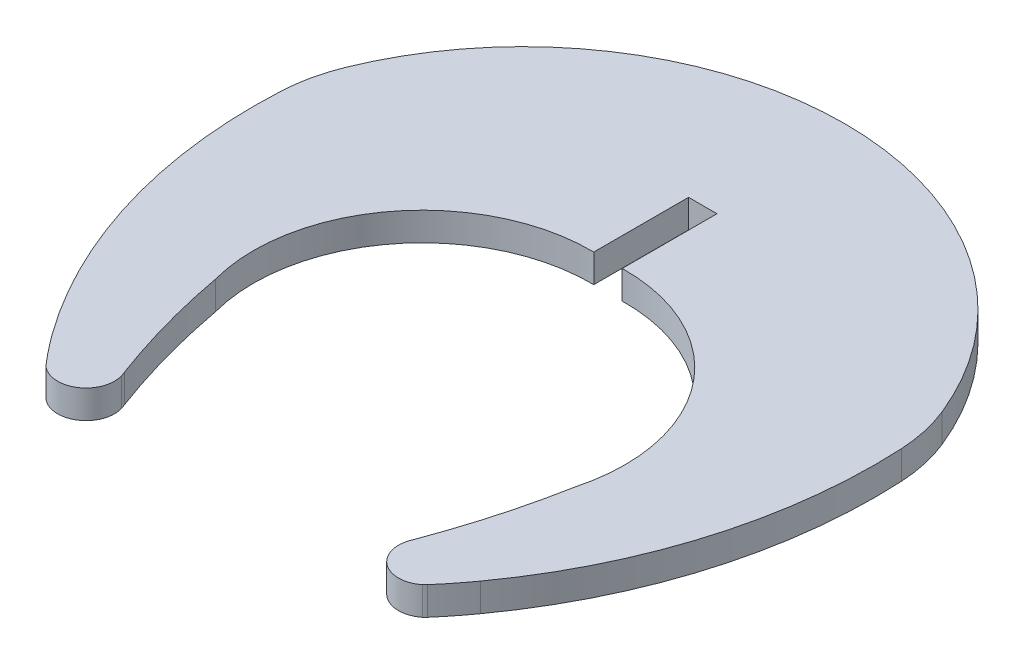
ISO-10303-21;
HEADER;
FILE_DESCRIPTION(('STEP AP214'),'2;1');
FILE_NAME('part.step','',(''),(''),'','','');
FILE_SCHEMA(('AUTOMOTIVE_DESIGN { 1 0 10303 214 1 1 1 1 }'));
ENDSEC;
DATA;
#1=APPLICATION_CONTEXT('core data for automotive mechanical design processes');
#2=APPLICATION_PROTOCOL_DEFINITION('international standard','automotive_design',2000,#1);
#3=PRODUCT_CONTEXT('',#1,'mechanical');
#4=PRODUCT('Part','Part','',(#3));
#5=PRODUCT_RELATED_PRODUCT_CATEGORY('part','',(#4));
#6=PRODUCT_DEFINITION_FORMATION('','',#4);
#7=PRODUCT_DEFINITION_CONTEXT('part definition',#1,'design');
#8=PRODUCT_DEFINITION('design','',#6,#7);
#9=PRODUCT_DEFINITION_SHAPE('','',#8);
#10=(LENGTH_UNIT() NAMED_UNIT(*) SI_UNIT(.MILLI.,.METRE.));
#11=(NAMED_UNIT(*) PLANE_ANGLE_UNIT() SI_UNIT($,.RADIAN.));
#12=(NAMED_UNIT(*) SI_UNIT($,.STERADIAN.) SOLID_ANGLE_UNIT());
#13=UNCERTAINTY_MEASURE_WITH_UNIT(LENGTH_MEASURE(1.E-05),#10,'distance_accuracy_value','');
#14=(GEOMETRIC_REPRESENTATION_CONTEXT(3) GLOBAL_UNCERTAINTY_ASSIGNED_CONTEXT((#13)) GLOBAL_UNIT_ASSIGNED_CONTEXT((#10,
#11,#12)) REPRESENTATION_CONTEXT('',''));
#15=CARTESIAN_POINT('',(0.,0.,0.));
#16=DIRECTION('',(0.,0.,1.));
#17=DIRECTION('',(1.,0.,0.));
#18=AXIS2_PLACEMENT_3D('',#15,#16,#17);
#19=CARTESIAN_POINT('',(182.612714371888,1.45,-181.633456238506));
#20=DIRECTION('',(0.,-1.,0.));
#21=DIRECTION('',(0.,0.,-1.));
#22=AXIS2_PLACEMENT_3D('',#19,#20,#21);
#23=CYLINDRICAL_SURFACE('',#22,16.503878528353);
#24=CARTESIAN_POINT('',(182.612714371888,0.,-181.633456238506));
#25=DIRECTION('',(0.,1.,0.));
#26=DIRECTION('',(0.,0.,1.));
#27=AXIS2_PLACEMENT_3D('',#24,#25,#26);
#28=CIRCLE('',#27,16.503878528353);
#29=CARTESIAN_POINT('',(197.904984008521,0.,-187.84026667859));
#30=VERTEX_POINT('',#29);
#31=CARTESIAN_POINT('',(167.320444243515,0.,-187.840265467047));
#32=VERTEX_POINT('',#31);
#33=EDGE_CURVE('E205',#30,#32,#28,.T.);
#34=ORIENTED_EDGE('',*,*,#33,.T.);
#35=DIRECTION('',(0.,-1.,0.));
#36=VECTOR('',#35,1.);
#37=CARTESIAN_POINT('',(167.320444243515,1.45,-187.840265467047));
#38=LINE('',#37,#36);
#39=CARTESIAN_POINT('',(167.320444243515,1.45,-187.840265467047));
#40=VERTEX_POINT('',#39);
#41=EDGE_CURVE('E11',#40,#32,#38,.T.);
#42=ORIENTED_EDGE('',*,*,#41,.F.);
#43=CARTESIAN_POINT('',(182.612714371888,1.45,-181.633456238506));
#44=DIRECTION('',(0.,1.,0.));
#45=DIRECTION('',(0.,0.,1.));
#46=AXIS2_PLACEMENT_3D('',#43,#44,#45);
#47=CIRCLE('',#46,16.503878528353);
#48=CARTESIAN_POINT('',(197.904984008521,1.45,-187.84026667859));
#49=VERTEX_POINT('',#48);
#50=EDGE_CURVE('E250',#49,#40,#47,.T.);
#51=ORIENTED_EDGE('',*,*,#50,.F.);
#52=DIRECTION('',(0.,-1.,0.));
#53=VECTOR('',#52,1.);
#54=CARTESIAN_POINT('',(197.904984008521,1.45,-187.84026667859));
#55=LINE('',#54,#53);
#56=EDGE_CURVE('E201',#49,#30,#55,.T.);
#57=ORIENTED_EDGE('',*,*,#56,.T.);
#58=EDGE_LOOP('',(#34,#42,#51,#57));
#59=FACE_BOUND('',#58,.T.);
#60=ADVANCED_FACE('F37',(#59),#23,.T.);
#61=CARTESIAN_POINT('',(175.011306634643,1.45,-184.718707417714));
#62=DIRECTION('',(0.,-1.,0.));
#63=DIRECTION('',(0.,0.,-1.));
#64=AXIS2_PLACEMENT_3D('',#61,#62,#63);
#65=CYLINDRICAL_SURFACE('',#64,8.30021017653311);
#66=CARTESIAN_POINT('',(175.011306634643,0.,-184.718707417714));
#67=DIRECTION('',(0.,1.,0.));
#68=DIRECTION('',(0.,0.,1.));
#69=AXIS2_PLACEMENT_3D('',#66,#67,#68);
#70=CIRCLE('',#69,8.30021017653311);
#71=CARTESIAN_POINT('',(166.722557517557,0.,-185.154743022486));
#72=VERTEX_POINT('',#71);
#73=EDGE_CURVE('E208',#32,#72,#70,.T.);
#74=ORIENTED_EDGE('',*,*,#73,.T.);
#75=DIRECTION('',(0.,-1.,0.));
#76=VECTOR('',#75,1.);
#77=CARTESIAN_POINT('',(166.722557517557,1.45,-185.154743022486));
#78=LINE('',#77,#76);
#79=CARTESIAN_POINT('',(166.722557517557,1.45,-185.154743022486));
#80=VERTEX_POINT('',#79);
#81=EDGE_CURVE('E45',#80,#72,#78,.T.);
#82=ORIENTED_EDGE('',*,*,#81,.F.);
#83=CARTESIAN_POINT('',(175.011306634643,1.45,-184.718707417714));
#84=DIRECTION('',(0.,1.,0.));
#85=DIRECTION('',(0.,0.,1.));
#86=AXIS2_PLACEMENT_3D('',#83,#84,#85);
#87=CIRCLE('',#86,8.30021017653311);
#88=EDGE_CURVE('E132',#40,#80,#87,.T.);
#89=ORIENTED_EDGE('',*,*,#88,.F.);
#90=ORIENTED_EDGE('',*,*,#41,.T.);
#91=EDGE_LOOP('',(#74,#82,#89,#90));
#92=FACE_BOUND('',#91,.T.);
#93=ADVANCED_FACE('F367',(#92),#65,.T.);
#94=CARTESIAN_POINT('',(192.86710672295,1.45,-183.801790058505));
#95=DIRECTION('',(0.,-1.,0.));
#96=DIRECTION('',(0.,0.,-1.));
#97=AXIS2_PLACEMENT_3D('',#94,#95,#96);
#98=CYLINDRICAL_SURFACE('',#97,26.179532747472);
#99=CARTESIAN_POINT('',(192.86710672295,0.,-183.801790058505));
#100=DIRECTION('',(0.,1.,0.));
#101=DIRECTION('',(0.,0.,1.));
#102=AXIS2_PLACEMENT_3D('',#99,#100,#101);
#103=CIRCLE('',#102,26.179532747472);
#104=CARTESIAN_POINT('',(171.632760569295,0.,-168.489361175315));
#105=VERTEX_POINT('',#104);
#106=EDGE_CURVE('E210',#72,#105,#103,.T.);
#107=ORIENTED_EDGE('',*,*,#106,.T.);
#108=DIRECTION('',(0.,-1.,0.));
#109=VECTOR('',#108,1.);
#110=CARTESIAN_POINT('',(171.632760569295,1.45,-168.489361175315));
#111=LINE('',#110,#109);
#112=CARTESIAN_POINT('',(171.632760569295,1.45,-168.489361175315));
#113=VERTEX_POINT('',#112);
#114=EDGE_CURVE('E286',#113,#105,#111,.T.);
#115=ORIENTED_EDGE('',*,*,#114,.F.);
#116=CARTESIAN_POINT('',(192.86710672295,1.45,-183.801790058505));
#117=DIRECTION('',(0.,1.,0.));
#118=DIRECTION('',(0.,0.,1.));
#119=AXIS2_PLACEMENT_3D('',#116,#117,#118);
#120=CIRCLE('',#119,26.179532747472);
#121=EDGE_CURVE('E294',#80,#113,#120,.T.);
#122=ORIENTED_EDGE('',*,*,#121,.F.);
#123=ORIENTED_EDGE('',*,*,#81,.T.);
#124=EDGE_LOOP('',(#107,#115,#122,#123));
#125=FACE_BOUND('',#124,.T.);
#126=ADVANCED_FACE('F292',(#125),#98,.T.);
#127=CARTESIAN_POINT('',(189.644454347905,1.45,-181.477881050326));
#128=DIRECTION('',(0.,-1.,0.));
#129=DIRECTION('',(0.,0.,-1.));
#130=AXIS2_PLACEMENT_3D('',#127,#128,#129);
#131=CYLINDRICAL_SURFACE('',#130,22.206367584951);
#132=CARTESIAN_POINT('',(189.644454347905,0.,-181.477881050326));
#133=DIRECTION('',(0.,1.,0.));
#134=DIRECTION('',(0.,0.,1.));
#135=AXIS2_PLACEMENT_3D('',#132,#133,#134);
#136=CIRCLE('',#135,22.206367584951);
#137=CARTESIAN_POINT('',(172.835611480412,0.,-166.966314533444));
#138=VERTEX_POINT('',#137);
#139=EDGE_CURVE('E212',#105,#138,#136,.T.);
#140=ORIENTED_EDGE('',*,*,#139,.T.);
#141=DIRECTION('',(0.,-1.,0.));
#142=VECTOR('',#141,1.);
#143=CARTESIAN_POINT('',(172.835611480412,1.45,-166.966314533444));
#144=LINE('',#143,#142);
#145=CARTESIAN_POINT('',(172.835611480412,1.45,-166.966314533444));
#146=VERTEX_POINT('',#145);
#147=EDGE_CURVE('E283',#146,#138,#144,.T.);
#148=ORIENTED_EDGE('',*,*,#147,.F.);
#149=CARTESIAN_POINT('',(189.644454347905,1.45,-181.477881050326));
#150=DIRECTION('',(0.,1.,0.));
#151=DIRECTION('',(0.,0.,1.));
#152=AXIS2_PLACEMENT_3D('',#149,#150,#151);
#153=CIRCLE('',#152,22.206367584951);
#154=EDGE_CURVE('E312',#113,#146,#153,.T.);
#155=ORIENTED_EDGE('',*,*,#154,.F.);
#156=ORIENTED_EDGE('',*,*,#114,.T.);
#157=EDGE_LOOP('',(#140,#148,#155,#156));
#158=FACE_BOUND('',#157,.T.);
#159=ADVANCED_FACE('F303',(#158),#131,.T.);
#160=CARTESIAN_POINT('',(173.759841379791,1.45,-167.764228359528));
#161=DIRECTION('',(0.,-1.,0.));
#162=DIRECTION('',(0.,0.,-1.));
#163=AXIS2_PLACEMENT_3D('',#160,#161,#162);
#164=CYLINDRICAL_SURFACE('',#163,1.22101080288459);
#165=CARTESIAN_POINT('',(173.759841379791,0.,-167.764228359528));
#166=DIRECTION('',(0.,1.,0.));
#167=DIRECTION('',(0.,0.,1.));
#168=AXIS2_PLACEMENT_3D('',#165,#166,#167);
#169=CIRCLE('',#168,1.22101080288459);
#170=CARTESIAN_POINT('',(172.966458578089,0.,-166.836106001902));
#171=VERTEX_POINT('',#170);
#172=EDGE_CURVE('E214',#138,#171,#169,.T.);
#173=ORIENTED_EDGE('',*,*,#172,.T.);
#174=DIRECTION('',(0.,-1.,0.));
#175=VECTOR('',#174,1.);
#176=CARTESIAN_POINT('',(172.966458578089,1.45,-166.836106001902));
#177=LINE('',#176,#175);
#178=CARTESIAN_POINT('',(172.966458578089,1.45,-166.836106001902));
#179=VERTEX_POINT('',#178);
#180=EDGE_CURVE('E280',#179,#171,#177,.T.);
#181=ORIENTED_EDGE('',*,*,#180,.F.);
#182=CARTESIAN_POINT('',(173.759841379791,1.45,-167.764228359528));
#183=DIRECTION('',(0.,1.,0.));
#184=DIRECTION('',(0.,0.,1.));
#185=AXIS2_PLACEMENT_3D('',#182,#183,#184);
#186=CIRCLE('',#185,1.22101080288459);
#187=EDGE_CURVE('E309',#146,#179,#186,.T.);
#188=ORIENTED_EDGE('',*,*,#187,.F.);
#189=ORIENTED_EDGE('',*,*,#147,.T.);
#190=EDGE_LOOP('',(#173,#181,#188,#189));
#191=FACE_BOUND('',#190,.T.);
#192=ADVANCED_FACE('F307',(#191),#164,.T.);
#193=CARTESIAN_POINT('',(173.874083340371,1.45,-167.977151794996));
#194=DIRECTION('',(0.,-1.,0.));
#195=DIRECTION('',(0.,0.,-1.));
#196=AXIS2_PLACEMENT_3D('',#193,#194,#195);
#197=CYLINDRICAL_SURFACE('',#196,1.45800144411667);
#198=CARTESIAN_POINT('',(173.874083340371,0.,-167.977151794996));
#199=DIRECTION('',(0.,1.,0.));
#200=DIRECTION('',(0.,0.,1.));
#201=AXIS2_PLACEMENT_3D('',#198,#199,#200);
#202=CIRCLE('',#201,1.45800144411667);
#203=CARTESIAN_POINT('',(175.271275174539,0.,-168.393832955576));
#204=VERTEX_POINT('',#203);
#205=EDGE_CURVE('E216',#171,#204,#202,.T.);
#206=ORIENTED_EDGE('',*,*,#205,.T.);
#207=DIRECTION('',(0.,-1.,0.));
#208=VECTOR('',#207,1.);
#209=CARTESIAN_POINT('',(175.271275174539,1.45,-168.393832955576));
#210=LINE('',#209,#208);
#211=CARTESIAN_POINT('',(175.271275174539,1.45,-168.393832955576));
#212=VERTEX_POINT('',#211);
#213=EDGE_CURVE('E277',#212,#204,#210,.T.);
#214=ORIENTED_EDGE('',*,*,#213,.F.);
#215=CARTESIAN_POINT('',(173.874083340371,1.45,-167.977151794996));
#216=DIRECTION('',(0.,1.,0.));
#217=DIRECTION('',(0.,0.,1.));
#218=AXIS2_PLACEMENT_3D('',#215,#216,#217);
#219=CIRCLE('',#218,1.45800144411667);
#220=EDGE_CURVE('E311',#179,#212,#219,.T.);
#221=ORIENTED_EDGE('',*,*,#220,.F.);
#222=ORIENTED_EDGE('',*,*,#180,.T.);
#223=EDGE_LOOP('',(#206,#214,#221,#222));
#224=FACE_BOUND('',#223,.T.);
#225=ADVANCED_FACE('F380',(#224),#197,.T.);
#226=CARTESIAN_POINT('',(173.127533725955,1.45,-167.754512840755));
#227=DIRECTION('',(0.,-1.,0.));
#228=DIRECTION('',(0.,0.,-1.));
#229=AXIS2_PLACEMENT_3D('',#226,#227,#228);
#230=CYLINDRICAL_SURFACE('',#229,2.23704215597095);
#231=CARTESIAN_POINT('',(173.127533725955,0.,-167.754512840755));
#232=DIRECTION('',(0.,1.,0.));
#233=DIRECTION('',(0.,0.,1.));
#234=AXIS2_PLACEMENT_3D('',#231,#232,#233);
#235=CIRCLE('',#234,2.23704215597095);
#236=CARTESIAN_POINT('',(175.186576563295,0.,-168.628984224844));
#237=VERTEX_POINT('',#236);
#238=EDGE_CURVE('E218',#204,#237,#235,.T.);
#239=ORIENTED_EDGE('',*,*,#238,.T.);
#240=DIRECTION('',(0.,-1.,0.));
#241=VECTOR('',#240,1.);
#242=CARTESIAN_POINT('',(175.186576563295,1.45,-168.628984224844));
#243=LINE('',#242,#241);
#244=CARTESIAN_POINT('',(175.186576563295,1.45,-168.628984224844));
#245=VERTEX_POINT('',#244);
#246=EDGE_CURVE('E275',#245,#237,#243,.T.);
#247=ORIENTED_EDGE('',*,*,#246,.F.);
#248=CARTESIAN_POINT('',(173.127533725955,1.45,-167.754512840755));
#249=DIRECTION('',(0.,1.,0.));
#250=DIRECTION('',(0.,0.,1.));
#251=AXIS2_PLACEMENT_3D('',#248,#249,#250);
#252=CIRCLE('',#251,2.23704215597095);
#253=EDGE_CURVE('E314',#212,#245,#252,.T.);
#254=ORIENTED_EDGE('',*,*,#253,.F.);
#255=ORIENTED_EDGE('',*,*,#213,.T.);
#256=EDGE_LOOP('',(#239,#247,#254,#255));
#257=FACE_BOUND('',#256,.T.);
#258=ADVANCED_FACE('F383',(#257),#230,.T.);
#259=CARTESIAN_POINT('',(211.313459335126,1.45,-182.154652294481));
#260=DIRECTION('',(0.,-1.,0.));
#261=DIRECTION('',(0.,0.,-1.));
#262=AXIS2_PLACEMENT_3D('',#259,#260,#261);
#263=CYLINDRICAL_SURFACE('',#262,38.575839012776);
#264=CARTESIAN_POINT('',(211.313459335126,0.,-182.154652294481));
#265=DIRECTION('',(0.,1.,0.));
#266=DIRECTION('',(0.,0.,1.));
#267=AXIS2_PLACEMENT_3D('',#264,#265,#266);
#268=CIRCLE('',#267,38.575839012776);
#269=CARTESIAN_POINT('',(173.386717996462,0.,-175.107834078456));
#270=VERTEX_POINT('',#269);
#271=EDGE_CURVE('E221',#270,#237,#268,.T.);
#272=ORIENTED_EDGE('',*,*,#271,.F.);
#273=DIRECTION('',(0.,-1.,0.));
#274=VECTOR('',#273,1.);
#275=CARTESIAN_POINT('',(173.386717996462,1.45,-175.107834078456));
#276=LINE('',#275,#274);
#277=CARTESIAN_POINT('',(173.386717996462,1.45,-175.107834078456));
#278=VERTEX_POINT('',#277);
#279=EDGE_CURVE('E273',#278,#270,#276,.T.);
#280=ORIENTED_EDGE('',*,*,#279,.F.);
#281=CARTESIAN_POINT('',(211.313459335126,1.45,-182.154652294481));
#282=DIRECTION('',(0.,1.,0.));
#283=DIRECTION('',(0.,0.,1.));
#284=AXIS2_PLACEMENT_3D('',#281,#282,#283);
#285=CIRCLE('',#284,38.575839012776);
#286=EDGE_CURVE('E320',#278,#245,#285,.T.);
#287=ORIENTED_EDGE('',*,*,#286,.T.);
#288=ORIENTED_EDGE('',*,*,#246,.T.);
#289=EDGE_LOOP('',(#272,#280,#287,#288));
#290=FACE_BOUND('',#289,.T.);
#291=ADVANCED_FACE('F387',(#290),#263,.F.);
#292=CARTESIAN_POINT('',(181.7488422074,1.45,-177.34541584711));
#293=DIRECTION('',(0.,-1.,0.));
#294=DIRECTION('',(0.,0.,-1.));
#295=AXIS2_PLACEMENT_3D('',#292,#293,#294);
#296=CYLINDRICAL_SURFACE('',#295,8.6563210136044);
#297=CARTESIAN_POINT('',(181.7488422074,0.,-177.34541584711));
#298=DIRECTION('',(0.,1.,0.));
#299=DIRECTION('',(0.,0.,1.));
#300=AXIS2_PLACEMENT_3D('',#297,#298,#299);
#301=CIRCLE('',#300,8.6563210136044);
#302=CARTESIAN_POINT('',(181.883713072282,0.,-186.000686110965));
#303=VERTEX_POINT('',#302);
#304=EDGE_CURVE('E224',#303,#270,#301,.T.);
#305=ORIENTED_EDGE('',*,*,#304,.F.);
#306=DIRECTION('',(0.,-1.,0.));
#307=VECTOR('',#306,1.);
#308=CARTESIAN_POINT('',(181.883713072282,1.45,-186.000686110965));
#309=LINE('',#308,#307);
#310=CARTESIAN_POINT('',(181.883713072282,1.45,-186.000686110965));
#311=VERTEX_POINT('',#310);
#312=EDGE_CURVE('E271',#311,#303,#309,.T.);
#313=ORIENTED_EDGE('',*,*,#312,.F.);
#314=CARTESIAN_POINT('',(181.7488422074,1.45,-177.34541584711));
#315=DIRECTION('',(0.,1.,0.));
#316=DIRECTION('',(0.,0.,1.));
#317=AXIS2_PLACEMENT_3D('',#314,#315,#316);
#318=CIRCLE('',#317,8.6563210136044);
#319=EDGE_CURVE('E323',#311,#278,#318,.T.);
#320=ORIENTED_EDGE('',*,*,#319,.T.);
#321=ORIENTED_EDGE('',*,*,#279,.T.);
#322=EDGE_LOOP('',(#305,#313,#320,#321));
#323=FACE_BOUND('',#322,.T.);
#324=ADVANCED_FACE('F391',(#323),#296,.F.);
#325=CARTESIAN_POINT('',(181.883719168316,1.45,-266.906653372685));
#326=DIRECTION('',(-0.999999999999997,0.,-7.5347145581294E-08));
#327=DIRECTION('',(-7.5347145581294E-08,0.,0.999999999999997));
#328=AXIS2_PLACEMENT_3D('',#325,#326,#327);
#329=PLANE('',#328);
#330=DIRECTION('',(7.5347145581294E-08,0.,-0.999999999999997));
#331=VECTOR('',#330,1.);
#332=CARTESIAN_POINT('',(181.883719168316,0.,-266.906653372685));
#333=LINE('',#332,#331);
#334=CARTESIAN_POINT('',(181.88371343847,0.,-190.86069175123));
#335=VERTEX_POINT('',#334);
#336=EDGE_CURVE('E227',#303,#335,#333,.T.);
#337=ORIENTED_EDGE('',*,*,#336,.T.);
#338=DIRECTION('',(0.,-1.,0.));
#339=VECTOR('',#338,1.);
#340=CARTESIAN_POINT('',(181.88371343847,1.45,-190.86069175123));
#341=LINE('',#340,#339);
#342=CARTESIAN_POINT('',(181.88371343847,1.45,-190.86069175123));
#343=VERTEX_POINT('',#342);
#344=EDGE_CURVE('E268',#343,#335,#341,.T.);
#345=ORIENTED_EDGE('',*,*,#344,.F.);
#346=DIRECTION('',(7.5347145581294E-08,0.,-0.999999999999997));
#347=VECTOR('',#346,1.);
#348=CARTESIAN_POINT('',(181.883719168316,1.45,-266.906653372685));
#349=LINE('',#348,#347);
#350=EDGE_CURVE('E326',#311,#343,#349,.T.);
#351=ORIENTED_EDGE('',*,*,#350,.F.);
#352=ORIENTED_EDGE('',*,*,#312,.T.);
#353=EDGE_LOOP('',(#337,#345,#351,#352));
#354=FACE_BOUND('',#353,.T.);
#355=ADVANCED_FACE('F395',(#354),#329,.F.);
#356=CARTESIAN_POINT('',(-48.360559474051,1.45,-190.86069175123));
#357=DIRECTION('',(0.,0.,-1.));
#358=DIRECTION('',(-1.,0.,0.));
#359=AXIS2_PLACEMENT_3D('',#356,#357,#358);
#360=PLANE('',#359);
#361=DIRECTION('',(1.,0.,0.));
#362=VECTOR('',#361,1.);
#363=CARTESIAN_POINT('',(-48.360559474051,0.,-190.86069175123));
#364=LINE('',#363,#362);
#365=CARTESIAN_POINT('',(183.341715192073,0.,-190.86069175123));
#366=VERTEX_POINT('',#365);
#367=EDGE_CURVE('E229',#335,#366,#364,.T.);
#368=ORIENTED_EDGE('',*,*,#367,.T.);
#369=DIRECTION('',(0.,-1.,0.));
#370=VECTOR('',#369,1.);
#371=CARTESIAN_POINT('',(183.341715192073,1.45,-190.86069175123));
#372=LINE('',#371,#370);
#373=CARTESIAN_POINT('',(183.341715192073,1.45,-190.86069175123));
#374=VERTEX_POINT('',#373);
#375=EDGE_CURVE('E266',#374,#366,#372,.T.);
#376=ORIENTED_EDGE('',*,*,#375,.F.);
#377=DIRECTION('',(1.,0.,0.));
#378=VECTOR('',#377,1.);
#379=CARTESIAN_POINT('',(-48.360559474051,1.45,-190.86069175123));
#380=LINE('',#379,#378);
#381=EDGE_CURVE('E328',#343,#374,#380,.T.);
#382=ORIENTED_EDGE('',*,*,#381,.F.);
#383=ORIENTED_EDGE('',*,*,#344,.T.);
#384=EDGE_LOOP('',(#368,#376,#382,#383));
#385=FACE_BOUND('',#384,.T.);
#386=ADVANCED_FACE('F399',(#385),#360,.F.);
#387=CARTESIAN_POINT('',(183.341722719431,1.45,-266.906647786037));
#388=DIRECTION('',(-0.999999999999995,0.,-9.89843377418558E-08));
#389=DIRECTION('',(-9.89843377418558E-08,0.,0.999999999999995));
#390=AXIS2_PLACEMENT_3D('',#387,#388,#389);
#391=PLANE('',#390);
#392=DIRECTION('',(9.89843377418558E-08,0.,-0.999999999999995));
#393=VECTOR('',#392,1.);
#394=CARTESIAN_POINT('',(183.341722719431,0.,-266.906647786037));
#395=LINE('',#394,#393);
#396=CARTESIAN_POINT('',(183.341714711008,0.,-186.000686125499));
#397=VERTEX_POINT('',#396);
#398=EDGE_CURVE('E232',#397,#366,#395,.T.);
#399=ORIENTED_EDGE('',*,*,#398,.F.);
#400=DIRECTION('',(0.,-1.,0.));
#401=VECTOR('',#400,1.);
#402=CARTESIAN_POINT('',(183.341714711008,1.45,-186.000686125499));
#403=LINE('',#402,#401);
#404=CARTESIAN_POINT('',(183.341714711008,1.45,-186.000686125499));
#405=VERTEX_POINT('',#404);
#406=EDGE_CURVE('E264',#405,#397,#403,.T.);
#407=ORIENTED_EDGE('',*,*,#406,.F.);
#408=DIRECTION('',(9.89843377418558E-08,0.,-0.999999999999995));
#409=VECTOR('',#408,1.);
#410=CARTESIAN_POINT('',(183.341722719431,1.45,-266.906647786037));
#411=LINE('',#410,#409);
#412=EDGE_CURVE('E330',#405,#374,#411,.T.);
#413=ORIENTED_EDGE('',*,*,#412,.T.);
#414=ORIENTED_EDGE('',*,*,#375,.T.);
#415=EDGE_LOOP('',(#399,#407,#413,#414));
#416=FACE_BOUND('',#415,.T.);
#417=ADVANCED_FACE('F403',(#416),#391,.T.);
#418=CARTESIAN_POINT('',(183.476586328408,1.45,-177.34541587337));
#419=DIRECTION('',(0.,-1.,0.));
#420=DIRECTION('',(0.,0.,-1.));
#421=AXIS2_PLACEMENT_3D('',#418,#419,#420);
#422=CYLINDRICAL_SURFACE('',#421,8.6563210136044);
#423=CARTESIAN_POINT('',(183.476586328408,0.,-177.34541587337));
#424=DIRECTION('',(0.,1.,0.));
#425=DIRECTION('',(0.,0.,1.));
#426=AXIS2_PLACEMENT_3D('',#423,#424,#425);
#427=CIRCLE('',#426,8.6563210136044);
#428=CARTESIAN_POINT('',(191.838710566938,0.,-175.107834207831));
#429=VERTEX_POINT('',#428);
#430=EDGE_CURVE('E235',#429,#397,#427,.T.);
#431=ORIENTED_EDGE('',*,*,#430,.F.);
#432=DIRECTION('',(0.,-1.,0.));
#433=VECTOR('',#432,1.);
#434=CARTESIAN_POINT('',(191.838710566938,1.45,-175.107834207831));
#435=LINE('',#434,#433);
#436=CARTESIAN_POINT('',(191.838710566938,1.45,-175.107834207831));
#437=VERTEX_POINT('',#436);
#438=EDGE_CURVE('E262',#437,#429,#435,.T.);
#439=ORIENTED_EDGE('',*,*,#438,.F.);
#440=CARTESIAN_POINT('',(183.476586328408,1.45,-177.34541587337));
#441=DIRECTION('',(0.,1.,0.));
#442=DIRECTION('',(0.,0.,1.));
#443=AXIS2_PLACEMENT_3D('',#440,#441,#442);
#444=CIRCLE('',#443,8.6563210136044);
#445=EDGE_CURVE('E333',#437,#405,#444,.T.);
#446=ORIENTED_EDGE('',*,*,#445,.T.);
#447=ORIENTED_EDGE('',*,*,#406,.T.);
#448=EDGE_LOOP('',(#431,#439,#446,#447));
#449=FACE_BOUND('',#448,.T.);
#450=ADVANCED_FACE('F407',(#449),#422,.F.);
#451=CARTESIAN_POINT('',(153.911969362643,1.45,-182.15465314704));
#452=DIRECTION('',(0.,-1.,0.));
#453=DIRECTION('',(0.,0.,-1.));
#454=AXIS2_PLACEMENT_3D('',#451,#452,#453);
#455=CYLINDRICAL_SURFACE('',#454,38.575839012776);
#456=CARTESIAN_POINT('',(153.911969362643,0.,-182.15465314704));
#457=DIRECTION('',(0.,1.,0.));
#458=DIRECTION('',(0.,0.,1.));
#459=AXIS2_PLACEMENT_3D('',#456,#457,#458);
#460=CIRCLE('',#459,38.575839012776);
#461=CARTESIAN_POINT('',(190.038850879978,0.,-168.628981726662));
#462=VERTEX_POINT('',#461);
#463=EDGE_CURVE('E238',#462,#429,#460,.T.);
#464=ORIENTED_EDGE('',*,*,#463,.F.);
#465=DIRECTION('',(0.,-1.,0.));
#466=VECTOR('',#465,1.);
#467=CARTESIAN_POINT('',(190.038850879978,1.45,-168.628981726662));
#468=LINE('',#467,#466);
#469=CARTESIAN_POINT('',(190.038850879978,1.45,-168.628981726662));
#470=VERTEX_POINT('',#469);
#471=EDGE_CURVE('E260',#470,#462,#468,.T.);
#472=ORIENTED_EDGE('',*,*,#471,.F.);
#473=CARTESIAN_POINT('',(153.911969362643,1.45,-182.15465314704));
#474=DIRECTION('',(0.,1.,0.));
#475=DIRECTION('',(0.,0.,1.));
#476=AXIS2_PLACEMENT_3D('',#473,#474,#475);
#477=CIRCLE('',#476,38.575839012776);
#478=EDGE_CURVE('E336',#470,#437,#477,.T.);
#479=ORIENTED_EDGE('',*,*,#478,.T.);
#480=ORIENTED_EDGE('',*,*,#438,.T.);
#481=EDGE_LOOP('',(#464,#472,#479,#480));
#482=FACE_BOUND('',#481,.T.);
#483=ADVANCED_FACE('F411',(#482),#455,.F.);
#484=CARTESIAN_POINT('',(192.097893844866,1.45,-167.754510111804));
#485=DIRECTION('',(0.,-1.,0.));
#486=DIRECTION('',(0.,0.,-1.));
#487=AXIS2_PLACEMENT_3D('',#484,#485,#486);
#488=CYLINDRICAL_SURFACE('',#487,2.23704236357872);
#489=CARTESIAN_POINT('',(192.097893844866,0.,-167.754510111804));
#490=DIRECTION('',(0.,1.,0.));
#491=DIRECTION('',(0.,0.,1.));
#492=AXIS2_PLACEMENT_3D('',#489,#490,#491);
#493=CIRCLE('',#492,2.23704236357872);
#494=CARTESIAN_POINT('',(189.954153009655,0.,-168.393833009794));
#495=VERTEX_POINT('',#494);
#496=EDGE_CURVE('E241',#462,#495,#493,.T.);
#497=ORIENTED_EDGE('',*,*,#496,.T.);
#498=DIRECTION('',(0.,-1.,0.));
#499=VECTOR('',#498,1.);
#500=CARTESIAN_POINT('',(189.954153009655,1.45,-168.393833009794));
#501=LINE('',#500,#499);
#502=CARTESIAN_POINT('',(189.954153009655,1.45,-168.393833009794));
#503=VERTEX_POINT('',#502);
#504=EDGE_CURVE('E257',#503,#495,#501,.T.);
#505=ORIENTED_EDGE('',*,*,#504,.F.);
#506=CARTESIAN_POINT('',(192.097893844866,1.45,-167.754510111804));
#507=DIRECTION('',(0.,1.,0.));
#508=DIRECTION('',(0.,0.,1.));
#509=AXIS2_PLACEMENT_3D('',#506,#507,#508);
#510=CIRCLE('',#509,2.23704236357872);
#511=EDGE_CURVE('E339',#470,#503,#510,.T.);
#512=ORIENTED_EDGE('',*,*,#511,.F.);
#513=ORIENTED_EDGE('',*,*,#471,.T.);
#514=EDGE_LOOP('',(#497,#505,#512,#513));
#515=FACE_BOUND('',#514,.T.);
#516=ADVANCED_FACE('F415',(#515),#488,.T.);
#517=CARTESIAN_POINT('',(191.351345103841,1.45,-167.977151870817));
#518=DIRECTION('',(0.,-1.,0.));
#519=DIRECTION('',(0.,0.,-1.));
#520=AXIS2_PLACEMENT_3D('',#517,#518,#519);
#521=CYLINDRICAL_SURFACE('',#520,1.458001687117);
#522=CARTESIAN_POINT('',(191.351345103841,0.,-167.977151870817));
#523=DIRECTION('',(0.,1.,0.));
#524=DIRECTION('',(0.,0.,1.));
#525=AXIS2_PLACEMENT_3D('',#522,#523,#524);
#526=CIRCLE('',#525,1.458001687117);
#527=CARTESIAN_POINT('',(192.258970166951,0.,-166.836106006511));
#528=VERTEX_POINT('',#527);
#529=EDGE_CURVE('E243',#495,#528,#526,.T.);
#530=ORIENTED_EDGE('',*,*,#529,.T.);
#531=DIRECTION('',(0.,-1.,0.));
#532=VECTOR('',#531,1.);
#533=CARTESIAN_POINT('',(192.258970166951,1.45,-166.836106006511));
#534=LINE('',#533,#532);
#535=CARTESIAN_POINT('',(192.258970166951,1.45,-166.836106006511));
#536=VERTEX_POINT('',#535);
#537=EDGE_CURVE('E254',#536,#528,#534,.T.);
#538=ORIENTED_EDGE('',*,*,#537,.F.);
#539=CARTESIAN_POINT('',(191.351345103841,1.45,-167.977151870817));
#540=DIRECTION('',(0.,1.,0.));
#541=DIRECTION('',(0.,0.,1.));
#542=AXIS2_PLACEMENT_3D('',#539,#540,#541);
#543=CIRCLE('',#542,1.458001687117);
#544=EDGE_CURVE('E341',#503,#536,#543,.T.);
#545=ORIENTED_EDGE('',*,*,#544,.F.);
#546=ORIENTED_EDGE('',*,*,#504,.T.);
#547=EDGE_LOOP('',(#530,#538,#545,#546));
#548=FACE_BOUND('',#547,.T.);
#549=ADVANCED_FACE('F348',(#548),#521,.T.);
#550=CARTESIAN_POINT('',(191.46558650553,1.45,-167.764227629225));
#551=DIRECTION('',(0.,-1.,0.));
#552=DIRECTION('',(0.,0.,-1.));
#553=AXIS2_PLACEMENT_3D('',#550,#551,#552);
#554=CYLINDRICAL_SURFACE('',#553,1.22101080288452);
#555=CARTESIAN_POINT('',(191.46558650553,0.,-167.764227629225));
#556=DIRECTION('',(0.,1.,0.));
#557=DIRECTION('',(0.,0.,1.));
#558=AXIS2_PLACEMENT_3D('',#555,#556,#557);
#559=CIRCLE('',#558,1.22101080288452);
#560=CARTESIAN_POINT('',(192.389815915787,0.,-166.966313236589));
#561=VERTEX_POINT('',#560);
#562=EDGE_CURVE('E245',#528,#561,#559,.T.);
#563=ORIENTED_EDGE('',*,*,#562,.T.);
#564=DIRECTION('',(0.,-1.,0.));
#565=VECTOR('',#564,1.);
#566=CARTESIAN_POINT('',(192.389815915787,1.45,-166.966313236589));
#567=LINE('',#566,#565);
#568=CARTESIAN_POINT('',(192.389815915787,1.45,-166.966313236589));
#569=VERTEX_POINT('',#568);
#570=EDGE_CURVE('E196',#569,#561,#567,.T.);
#571=ORIENTED_EDGE('',*,*,#570,.F.);
#572=CARTESIAN_POINT('',(191.46558650553,1.45,-167.764227629225));
#573=DIRECTION('',(0.,1.,0.));
#574=DIRECTION('',(0.,0.,1.));
#575=AXIS2_PLACEMENT_3D('',#572,#573,#574);
#576=CIRCLE('',#575,1.22101080288452);
#577=EDGE_CURVE('E187',#536,#569,#576,.T.);
#578=ORIENTED_EDGE('',*,*,#577,.F.);
#579=ORIENTED_EDGE('',*,*,#537,.T.);
#580=EDGE_LOOP('',(#563,#571,#578,#579));
#581=FACE_BOUND('',#580,.T.);
#582=ADVANCED_FACE('F352',(#581),#554,.T.);
#583=CARTESIAN_POINT('',(175.58097513687,1.45,-181.477881800829));
#584=DIRECTION('',(0.,-1.,0.));
#585=DIRECTION('',(0.,0.,-1.));
#586=AXIS2_PLACEMENT_3D('',#583,#584,#585);
#587=CYLINDRICAL_SURFACE('',#586,22.20636734195);
#588=CARTESIAN_POINT('',(175.58097513687,0.,-181.477881800829));
#589=DIRECTION('',(0.,1.,0.));
#590=DIRECTION('',(0.,0.,1.));
#591=AXIS2_PLACEMENT_3D('',#588,#589,#590);
#592=CIRCLE('',#591,22.20636734195);
#593=CARTESIAN_POINT('',(193.592669429526,0.,-168.489363054122));
#594=VERTEX_POINT('',#593);
#595=EDGE_CURVE('E195',#561,#594,#592,.T.);
#596=ORIENTED_EDGE('',*,*,#595,.T.);
#597=DIRECTION('',(0.,-1.,0.));
#598=VECTOR('',#597,1.);
#599=CARTESIAN_POINT('',(193.592669429526,1.45,-168.489363054122));
#600=LINE('',#599,#598);
#601=CARTESIAN_POINT('',(193.592669429526,1.45,-168.489363054122));
#602=VERTEX_POINT('',#601);
#603=EDGE_CURVE('E192',#602,#594,#600,.T.);
#604=ORIENTED_EDGE('',*,*,#603,.F.);
#605=CARTESIAN_POINT('',(175.58097513687,1.45,-181.477881800829));
#606=DIRECTION('',(0.,1.,0.));
#607=DIRECTION('',(0.,0.,1.));
#608=AXIS2_PLACEMENT_3D('',#605,#606,#607);
#609=CIRCLE('',#608,22.20636734195);
#610=EDGE_CURVE('E181',#569,#602,#609,.T.);
#611=ORIENTED_EDGE('',*,*,#610,.F.);
#612=ORIENTED_EDGE('',*,*,#570,.T.);
#613=EDGE_LOOP('',(#596,#604,#611,#612));
#614=FACE_BOUND('',#613,.T.);
#615=ADVANCED_FACE('F193',(#614),#587,.T.);
#616=CARTESIAN_POINT('',(172.358321661371,1.45,-183.801790113878));
#617=DIRECTION('',(0.,-1.,0.));
#618=DIRECTION('',(0.,0.,-1.));
#619=AXIS2_PLACEMENT_3D('',#616,#617,#618);
#620=CYLINDRICAL_SURFACE('',#619,26.179532990473);
#621=CARTESIAN_POINT('',(172.358321661371,0.,-183.801790113878));
#622=DIRECTION('',(0.,1.,0.));
#623=DIRECTION('',(0.,0.,1.));
#624=AXIS2_PLACEMENT_3D('',#621,#622,#623);
#625=CIRCLE('',#624,26.179532990473);
#626=CARTESIAN_POINT('',(198.50287106846,0.,-185.15474388232));
#627=VERTEX_POINT('',#626);
#628=EDGE_CURVE('E118',#594,#627,#625,.T.);
#629=ORIENTED_EDGE('',*,*,#628,.T.);
#630=DIRECTION('',(0.,-1.,0.));
#631=VECTOR('',#630,1.);
#632=CARTESIAN_POINT('',(198.50287106846,1.45,-185.15474388232));
#633=LINE('',#632,#631);
#634=CARTESIAN_POINT('',(198.50287106846,1.45,-185.15474388232));
#635=VERTEX_POINT('',#634);
#636=EDGE_CURVE('E197',#635,#627,#633,.T.);
#637=ORIENTED_EDGE('',*,*,#636,.F.);
#638=CARTESIAN_POINT('',(172.358321661371,1.45,-183.801790113878));
#639=DIRECTION('',(0.,1.,0.));
#640=DIRECTION('',(0.,0.,1.));
#641=AXIS2_PLACEMENT_3D('',#638,#639,#640);
#642=CIRCLE('',#641,26.179532990473);
#643=EDGE_CURVE('E185',#602,#635,#642,.T.);
#644=ORIENTED_EDGE('',*,*,#643,.F.);
#645=ORIENTED_EDGE('',*,*,#603,.T.);
#646=EDGE_LOOP('',(#629,#637,#644,#645));
#647=FACE_BOUND('',#646,.T.);
#648=ADVANCED_FACE('F199',(#647),#620,.T.);
#649=CARTESIAN_POINT('',(190.21412197985,1.45,-184.718707736239));
#650=DIRECTION('',(0.,-1.,0.));
#651=DIRECTION('',(0.,0.,-1.));
#652=AXIS2_PLACEMENT_3D('',#649,#650,#651);
#653=CYLINDRICAL_SURFACE('',#652,8.3002101765331);
#654=CARTESIAN_POINT('',(190.21412197985,0.,-184.718707736239));
#655=DIRECTION('',(0.,1.,0.));
#656=DIRECTION('',(0.,0.,1.));
#657=AXIS2_PLACEMENT_3D('',#654,#655,#656);
#658=CIRCLE('',#657,8.3002101765331);
#659=EDGE_CURVE('E124',#627,#30,#658,.T.);
#660=ORIENTED_EDGE('',*,*,#659,.T.);
#661=ORIENTED_EDGE('',*,*,#56,.F.);
#662=CARTESIAN_POINT('',(190.21412197985,1.45,-184.718707736239));
#663=DIRECTION('',(0.,1.,0.));
#664=DIRECTION('',(0.,0.,1.));
#665=AXIS2_PLACEMENT_3D('',#662,#663,#664);
#666=CIRCLE('',#665,8.3002101765331);
#667=EDGE_CURVE('E53',#635,#49,#666,.T.);
#668=ORIENTED_EDGE('',*,*,#667,.F.);
#669=ORIENTED_EDGE('',*,*,#636,.T.);
#670=EDGE_LOOP('',(#660,#661,#668,#669));
#671=FACE_BOUND('',#670,.T.);
#672=ADVANCED_FACE('F356',(#671),#653,.T.);
#673=CARTESIAN_POINT('',(-48.360559474051,1.45,-266.906670720934));
#674=DIRECTION('',(0.,1.,0.));
#675=DIRECTION('',(0.,0.,1.));
#676=AXIS2_PLACEMENT_3D('',#673,#674,#675);
#677=PLANE('',#676);
#678=ORIENTED_EDGE('',*,*,#50,.T.);
#679=ORIENTED_EDGE('',*,*,#88,.T.);
#680=ORIENTED_EDGE('',*,*,#121,.T.);
#681=ORIENTED_EDGE('',*,*,#154,.T.);
#682=ORIENTED_EDGE('',*,*,#187,.T.);
#683=ORIENTED_EDGE('',*,*,#220,.T.);
#684=ORIENTED_EDGE('',*,*,#253,.T.);
#685=ORIENTED_EDGE('',*,*,#286,.F.);
#686=ORIENTED_EDGE('',*,*,#319,.F.);
#687=ORIENTED_EDGE('',*,*,#350,.T.);
#688=ORIENTED_EDGE('',*,*,#381,.T.);
#689=ORIENTED_EDGE('',*,*,#412,.F.);
#690=ORIENTED_EDGE('',*,*,#445,.F.);
#691=ORIENTED_EDGE('',*,*,#478,.F.);
#692=ORIENTED_EDGE('',*,*,#511,.T.);
#693=ORIENTED_EDGE('',*,*,#544,.T.);
#694=ORIENTED_EDGE('',*,*,#577,.T.);
#695=ORIENTED_EDGE('',*,*,#610,.T.);
#696=ORIENTED_EDGE('',*,*,#643,.T.);
#697=ORIENTED_EDGE('',*,*,#667,.T.);
#698=EDGE_LOOP('',(#678,#679,#680,#681,#682,#683,#684,#685,#686,#687,#688,#689,#690,#691,#692,
#693,#694,#695,#696,#697));
#699=FACE_BOUND('',#698,.T.);
#700=ADVANCED_FACE('F183',(#699),#677,.T.);
#701=CARTESIAN_POINT('',(-48.360559474051,0.,-266.906670720934));
#702=DIRECTION('',(0.,1.,0.));
#703=DIRECTION('',(0.,0.,1.));
#704=AXIS2_PLACEMENT_3D('',#701,#702,#703);
#705=PLANE('',#704);
#706=ORIENTED_EDGE('',*,*,#33,.F.);
#707=ORIENTED_EDGE('',*,*,#659,.F.);
#708=ORIENTED_EDGE('',*,*,#628,.F.);
#709=ORIENTED_EDGE('',*,*,#595,.F.);
#710=ORIENTED_EDGE('',*,*,#562,.F.);
#711=ORIENTED_EDGE('',*,*,#529,.F.);
#712=ORIENTED_EDGE('',*,*,#496,.F.);
#713=ORIENTED_EDGE('',*,*,#463,.T.);
#714=ORIENTED_EDGE('',*,*,#430,.T.);
#715=ORIENTED_EDGE('',*,*,#398,.T.);
#716=ORIENTED_EDGE('',*,*,#367,.F.);
#717=ORIENTED_EDGE('',*,*,#336,.F.);
#718=ORIENTED_EDGE('',*,*,#304,.T.);
#719=ORIENTED_EDGE('',*,*,#271,.T.);
#720=ORIENTED_EDGE('',*,*,#238,.F.);
#721=ORIENTED_EDGE('',*,*,#205,.F.);
#722=ORIENTED_EDGE('',*,*,#172,.F.);
#723=ORIENTED_EDGE('',*,*,#139,.F.);
#724=ORIENTED_EDGE('',*,*,#106,.F.);
#725=ORIENTED_EDGE('',*,*,#73,.F.);
#726=EDGE_LOOP('',(#706,#707,#708,#709,#710,#711,#712,#713,#714,#715,#716,#717,#718,#719,#720,
#721,#722,#723,#724,#725));
#727=FACE_BOUND('',#726,.T.);
#728=ADVANCED_FACE('F298',(#727),#705,.F.);
#729=CLOSED_SHELL('',(#60,#93,#126,#159,#192,#225,#258,#291,#324,#355,#386,#417,#450,#483,#516,
#549,#582,#615,#648,#672,#700,#728));
#730=MANIFOLD_SOLID_BREP('B2',#729);
#731=ADVANCED_BREP_SHAPE_REPRESENTATION('',(#18,#730),#14);
#732=SHAPE_DEFINITION_REPRESENTATION(#9,#731);
ENDSEC;
END-ISO-10303-21;
